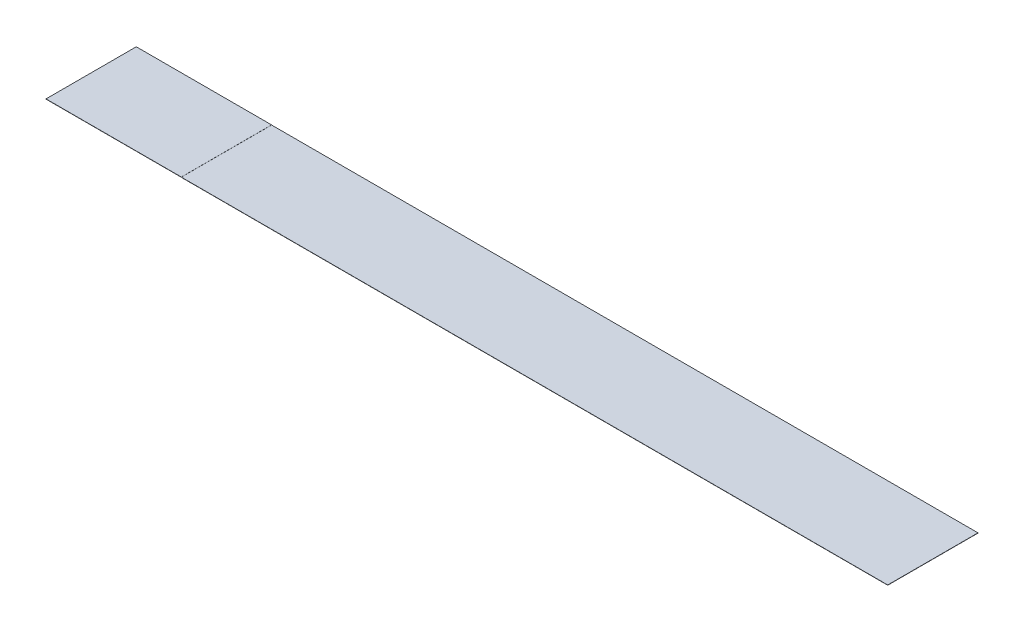
ISO-10303-21;
HEADER;
FILE_DESCRIPTION(('STEP AP214'),'2;1');
FILE_NAME('part.step','',(''),(''),'','','');
FILE_SCHEMA(('AUTOMOTIVE_DESIGN { 1 0 10303 214 1 1 1 1 }'));
ENDSEC;
DATA;
#1=APPLICATION_CONTEXT('core data for automotive mechanical design processes');
#2=APPLICATION_PROTOCOL_DEFINITION('international standard','automotive_design',2000,#1);
#3=PRODUCT_CONTEXT('',#1,'mechanical');
#4=PRODUCT('Part','Part','',(#3));
#5=PRODUCT_RELATED_PRODUCT_CATEGORY('part','',(#4));
#6=PRODUCT_DEFINITION_FORMATION('','',#4);
#7=PRODUCT_DEFINITION_CONTEXT('part definition',#1,'design');
#8=PRODUCT_DEFINITION('design','',#6,#7);
#9=PRODUCT_DEFINITION_SHAPE('','',#8);
#10=(LENGTH_UNIT() NAMED_UNIT(*) SI_UNIT(.MILLI.,.METRE.));
#11=(NAMED_UNIT(*) PLANE_ANGLE_UNIT() SI_UNIT($,.RADIAN.));
#12=(NAMED_UNIT(*) SI_UNIT($,.STERADIAN.) SOLID_ANGLE_UNIT());
#13=UNCERTAINTY_MEASURE_WITH_UNIT(LENGTH_MEASURE(1.E-05),#10,'distance_accuracy_value','');
#14=(GEOMETRIC_REPRESENTATION_CONTEXT(3) GLOBAL_UNCERTAINTY_ASSIGNED_CONTEXT((#13)) GLOBAL_UNIT_ASSIGNED_CONTEXT((#10,
#11,#12)) REPRESENTATION_CONTEXT('',''));
#15=CARTESIAN_POINT('',(0.,0.,0.));
#16=DIRECTION('',(0.,0.,1.));
#17=DIRECTION('',(1.,0.,0.));
#18=AXIS2_PLACEMENT_3D('',#15,#16,#17);
#19=CARTESIAN_POINT('',(264.4,0.15,30.5));
#20=DIRECTION('',(0.,1.,0.));
#21=DIRECTION('',(0.,0.,1.));
#22=AXIS2_PLACEMENT_3D('',#19,#20,#21);
#23=PLANE('',#22);
#24=DIRECTION('',(-1.,0.,0.));
#25=VECTOR('',#24,1.);
#26=CARTESIAN_POINT('',(-264.4,0.15,-30.5));
#27=LINE('',#26,#25);
#28=CARTESIAN_POINT('',(284.4,0.15,-30.5));
#29=VERTEX_POINT('',#28);
#30=CARTESIAN_POINT('',(-192.95,0.15,-30.5));
#31=VERTEX_POINT('',#30);
#32=EDGE_CURVE('E121',#29,#31,#27,.T.);
#33=ORIENTED_EDGE('',*,*,#32,.T.);
#34=DIRECTION('',(0.,0.,1.));
#35=VECTOR('',#34,1.);
#36=CARTESIAN_POINT('',(-192.95,0.15,-121.950025714684));
#37=LINE('',#36,#35);
#38=CARTESIAN_POINT('',(-192.95,0.15,30.5));
#39=VERTEX_POINT('',#38);
#40=EDGE_CURVE('E153',#31,#39,#37,.T.);
#41=ORIENTED_EDGE('',*,*,#40,.T.);
#42=DIRECTION('',(1.,0.,0.));
#43=VECTOR('',#42,1.);
#44=CARTESIAN_POINT('',(-264.4,0.15,30.5));
#45=LINE('',#44,#43);
#46=CARTESIAN_POINT('',(284.4,0.15,30.5));
#47=VERTEX_POINT('',#46);
#48=EDGE_CURVE('E41',#39,#47,#45,.T.);
#49=ORIENTED_EDGE('',*,*,#48,.T.);
#50=DIRECTION('',(0.,0.,-1.));
#51=VECTOR('',#50,1.);
#52=CARTESIAN_POINT('',(284.4,0.15,-30.5));
#53=LINE('',#52,#51);
#54=EDGE_CURVE('E141',#47,#29,#53,.T.);
#55=ORIENTED_EDGE('',*,*,#54,.T.);
#56=EDGE_LOOP('',(#33,#41,#49,#55));
#57=FACE_BOUND('',#56,.T.);
#58=ADVANCED_FACE('F33',(#57),#23,.T.);
#59=CARTESIAN_POINT('',(-264.4,0.15,-30.5));
#60=DIRECTION('',(0.,0.,1.));
#61=DIRECTION('',(1.,0.,0.));
#62=AXIS2_PLACEMENT_3D('',#59,#60,#61);
#63=PLANE('',#62);
#64=DIRECTION('',(0.,1.,0.));
#65=VECTOR('',#64,1.);
#66=CARTESIAN_POINT('',(-192.95,0.15,-30.5));
#67=LINE('',#66,#65);
#68=CARTESIAN_POINT('',(-192.95,0.,-30.5));
#69=VERTEX_POINT('',#68);
#70=CARTESIAN_POINT('',(-192.95,0.06858,-30.5));
#71=VERTEX_POINT('',#70);
#72=EDGE_CURVE('E104',#69,#71,#67,.T.);
#73=ORIENTED_EDGE('',*,*,#72,.T.);
#74=DIRECTION('',(-1.,0.,0.));
#75=VECTOR('',#74,1.);
#76=CARTESIAN_POINT('',(-264.4,0.06858,-30.5));
#77=LINE('',#76,#75);
#78=CARTESIAN_POINT('',(-284.4,0.06858,-30.5));
#79=VERTEX_POINT('',#78);
#80=EDGE_CURVE('E173',#71,#79,#77,.T.);
#81=ORIENTED_EDGE('',*,*,#80,.T.);
#82=DIRECTION('',(0.,1.,0.));
#83=VECTOR('',#82,1.);
#84=CARTESIAN_POINT('',(-284.4,-64.1950153828161,-30.5));
#85=LINE('',#84,#83);
#86=CARTESIAN_POINT('',(-284.4,0.21858,-30.5));
#87=VERTEX_POINT('',#86);
#88=EDGE_CURVE('E135',#79,#87,#85,.T.);
#89=ORIENTED_EDGE('',*,*,#88,.T.);
#90=DIRECTION('',(1.,0.,0.));
#91=VECTOR('',#90,1.);
#92=CARTESIAN_POINT('',(-284.4,0.21858,-30.5));
#93=LINE('',#92,#91);
#94=CARTESIAN_POINT('',(-192.95,0.21858,-30.5));
#95=VERTEX_POINT('',#94);
#96=EDGE_CURVE('E146',#87,#95,#93,.T.);
#97=ORIENTED_EDGE('',*,*,#96,.T.);
#98=DIRECTION('',(0.,-1.,0.));
#99=VECTOR('',#98,1.);
#100=CARTESIAN_POINT('',(-192.95,0.15,-30.5));
#101=LINE('',#100,#99);
#102=EDGE_CURVE('E158',#95,#31,#101,.T.);
#103=ORIENTED_EDGE('',*,*,#102,.T.);
#104=ORIENTED_EDGE('',*,*,#32,.F.);
#105=DIRECTION('',(0.,1.,0.));
#106=VECTOR('',#105,1.);
#107=CARTESIAN_POINT('',(284.4,-64.1950153828161,-30.5));
#108=LINE('',#107,#106);
#109=CARTESIAN_POINT('',(284.4,0.,-30.5));
#110=VERTEX_POINT('',#109);
#111=EDGE_CURVE('E140',#110,#29,#108,.T.);
#112=ORIENTED_EDGE('',*,*,#111,.F.);
#113=DIRECTION('',(-1.,0.,0.));
#114=VECTOR('',#113,1.);
#115=CARTESIAN_POINT('',(-264.4,0.,-30.5));
#116=LINE('',#115,#114);
#117=EDGE_CURVE('E122',#110,#69,#116,.T.);
#118=ORIENTED_EDGE('',*,*,#117,.T.);
#119=EDGE_LOOP('',(#73,#81,#89,#97,#103,#104,#112,#118));
#120=FACE_BOUND('',#119,.T.);
#121=ADVANCED_FACE('F35',(#120),#63,.F.);
#122=CARTESIAN_POINT('',(-264.4,0.15,30.5));
#123=DIRECTION('',(0.,0.,-1.));
#124=DIRECTION('',(-1.,0.,0.));
#125=AXIS2_PLACEMENT_3D('',#122,#123,#124);
#126=PLANE('',#125);
#127=DIRECTION('',(0.,1.,0.));
#128=VECTOR('',#127,1.);
#129=CARTESIAN_POINT('',(-284.4,-64.1950153828161,30.5));
#130=LINE('',#129,#128);
#131=CARTESIAN_POINT('',(-284.4,0.0685799999999986,30.5));
#132=VERTEX_POINT('',#131);
#133=CARTESIAN_POINT('',(-284.4,0.21858,30.5));
#134=VERTEX_POINT('',#133);
#135=EDGE_CURVE('E126',#132,#134,#130,.T.);
#136=ORIENTED_EDGE('',*,*,#135,.F.);
#137=DIRECTION('',(-1.,0.,0.));
#138=VECTOR('',#137,1.);
#139=CARTESIAN_POINT('',(-284.4,0.06858,30.5));
#140=LINE('',#139,#138);
#141=CARTESIAN_POINT('',(-192.95,0.06858,30.5));
#142=VERTEX_POINT('',#141);
#143=EDGE_CURVE('E47',#142,#132,#140,.T.);
#144=ORIENTED_EDGE('',*,*,#143,.F.);
#145=DIRECTION('',(0.,1.,0.));
#146=VECTOR('',#145,1.);
#147=CARTESIAN_POINT('',(-192.95,0.,30.5));
#148=LINE('',#147,#146);
#149=CARTESIAN_POINT('',(-192.95,0.,30.5));
#150=VERTEX_POINT('',#149);
#151=EDGE_CURVE('E102',#150,#142,#148,.T.);
#152=ORIENTED_EDGE('',*,*,#151,.F.);
#153=DIRECTION('',(1.,0.,0.));
#154=VECTOR('',#153,1.);
#155=CARTESIAN_POINT('',(-264.4,0.,30.5));
#156=LINE('',#155,#154);
#157=CARTESIAN_POINT('',(284.4,0.,30.5));
#158=VERTEX_POINT('',#157);
#159=EDGE_CURVE('E114',#150,#158,#156,.T.);
#160=ORIENTED_EDGE('',*,*,#159,.T.);
#161=DIRECTION('',(0.,1.,0.));
#162=VECTOR('',#161,1.);
#163=CARTESIAN_POINT('',(284.4,-64.1950153828161,30.5));
#164=LINE('',#163,#162);
#165=EDGE_CURVE('E138',#158,#47,#164,.T.);
#166=ORIENTED_EDGE('',*,*,#165,.T.);
#167=ORIENTED_EDGE('',*,*,#48,.F.);
#168=DIRECTION('',(0.,1.,0.));
#169=VECTOR('',#168,1.);
#170=CARTESIAN_POINT('',(-192.95,0.15,30.5));
#171=LINE('',#170,#169);
#172=CARTESIAN_POINT('',(-192.95,0.21858,30.5));
#173=VERTEX_POINT('',#172);
#174=EDGE_CURVE('E55',#39,#173,#171,.T.);
#175=ORIENTED_EDGE('',*,*,#174,.T.);
#176=DIRECTION('',(-1.,0.,0.));
#177=VECTOR('',#176,1.);
#178=CARTESIAN_POINT('',(-284.4,0.21858,30.5));
#179=LINE('',#178,#177);
#180=EDGE_CURVE('E156',#173,#134,#179,.T.);
#181=ORIENTED_EDGE('',*,*,#180,.T.);
#182=EDGE_LOOP('',(#136,#144,#152,#160,#166,#167,#175,#181));
#183=FACE_BOUND('',#182,.T.);
#184=ADVANCED_FACE('F112',(#183),#126,.F.);
#185=CARTESIAN_POINT('',(264.4,0.,30.5));
#186=DIRECTION('',(0.,1.,0.));
#187=DIRECTION('',(0.,0.,1.));
#188=AXIS2_PLACEMENT_3D('',#185,#186,#187);
#189=PLANE('',#188);
#190=ORIENTED_EDGE('',*,*,#159,.F.);
#191=DIRECTION('',(0.,0.,1.));
#192=VECTOR('',#191,1.);
#193=CARTESIAN_POINT('',(-192.95,0.,-30.50005));
#194=LINE('',#193,#192);
#195=EDGE_CURVE('E98',#69,#150,#194,.T.);
#196=ORIENTED_EDGE('',*,*,#195,.F.);
#197=ORIENTED_EDGE('',*,*,#117,.F.);
#198=DIRECTION('',(0.,0.,1.));
#199=VECTOR('',#198,1.);
#200=CARTESIAN_POINT('',(284.4,0.,-30.5));
#201=LINE('',#200,#199);
#202=EDGE_CURVE('E119',#110,#158,#201,.T.);
#203=ORIENTED_EDGE('',*,*,#202,.T.);
#204=EDGE_LOOP('',(#190,#196,#197,#203));
#205=FACE_BOUND('',#204,.T.);
#206=ADVANCED_FACE('F117',(#205),#189,.F.);
#207=CARTESIAN_POINT('',(-284.4,-64.1950153828161,-30.5));
#208=DIRECTION('',(-1.,0.,0.));
#209=DIRECTION('',(0.,0.,1.));
#210=AXIS2_PLACEMENT_3D('',#207,#208,#209);
#211=PLANE('',#210);
#212=DIRECTION('',(0.,0.,-1.));
#213=VECTOR('',#212,1.);
#214=CARTESIAN_POINT('',(-284.4,0.0685799999999986,-30.5));
#215=LINE('',#214,#213);
#216=EDGE_CURVE('E11',#132,#79,#215,.T.);
#217=ORIENTED_EDGE('',*,*,#216,.F.);
#218=ORIENTED_EDGE('',*,*,#135,.T.);
#219=DIRECTION('',(0.,0.,1.));
#220=VECTOR('',#219,1.);
#221=CARTESIAN_POINT('',(-284.4,0.21858,-121.950025714684));
#222=LINE('',#221,#220);
#223=EDGE_CURVE('E159',#87,#134,#222,.T.);
#224=ORIENTED_EDGE('',*,*,#223,.F.);
#225=ORIENTED_EDGE('',*,*,#88,.F.);
#226=EDGE_LOOP('',(#217,#218,#224,#225));
#227=FACE_BOUND('',#226,.T.);
#228=ADVANCED_FACE('F189',(#227),#211,.T.);
#229=CARTESIAN_POINT('',(284.4,-64.1950153828161,-30.5));
#230=DIRECTION('',(1.,0.,0.));
#231=DIRECTION('',(0.,0.,-1.));
#232=AXIS2_PLACEMENT_3D('',#229,#230,#231);
#233=PLANE('',#232);
#234=ORIENTED_EDGE('',*,*,#202,.F.);
#235=ORIENTED_EDGE('',*,*,#111,.T.);
#236=ORIENTED_EDGE('',*,*,#54,.F.);
#237=ORIENTED_EDGE('',*,*,#165,.F.);
#238=EDGE_LOOP('',(#234,#235,#236,#237));
#239=FACE_BOUND('',#238,.T.);
#240=ADVANCED_FACE('F181',(#239),#233,.T.);
#241=CARTESIAN_POINT('',(-284.4,0.21858,-121.950025714684));
#242=DIRECTION('',(0.,1.,0.));
#243=DIRECTION('',(0.,0.,1.));
#244=AXIS2_PLACEMENT_3D('',#241,#242,#243);
#245=PLANE('',#244);
#246=ORIENTED_EDGE('',*,*,#96,.F.);
#247=ORIENTED_EDGE('',*,*,#223,.T.);
#248=ORIENTED_EDGE('',*,*,#180,.F.);
#249=DIRECTION('',(0.,0.,1.));
#250=VECTOR('',#249,1.);
#251=CARTESIAN_POINT('',(-192.95,0.21858,-121.950025714684));
#252=LINE('',#251,#250);
#253=EDGE_CURVE('E150',#95,#173,#252,.T.);
#254=ORIENTED_EDGE('',*,*,#253,.F.);
#255=EDGE_LOOP('',(#246,#247,#248,#254));
#256=FACE_BOUND('',#255,.T.);
#257=ADVANCED_FACE('F187',(#256),#245,.T.);
#258=CARTESIAN_POINT('',(-192.95,0.15,-121.950025714684));
#259=DIRECTION('',(1.,0.,0.));
#260=DIRECTION('',(0.,0.,-1.));
#261=AXIS2_PLACEMENT_3D('',#258,#259,#260);
#262=PLANE('',#261);
#263=ORIENTED_EDGE('',*,*,#102,.F.);
#264=ORIENTED_EDGE('',*,*,#253,.T.);
#265=ORIENTED_EDGE('',*,*,#174,.F.);
#266=ORIENTED_EDGE('',*,*,#40,.F.);
#267=EDGE_LOOP('',(#263,#264,#265,#266));
#268=FACE_BOUND('',#267,.T.);
#269=ADVANCED_FACE('F185',(#268),#262,.T.);
#270=CARTESIAN_POINT('',(-192.95,0.,-30.50005));
#271=DIRECTION('',(1.,0.,0.));
#272=DIRECTION('',(0.,0.,-1.));
#273=AXIS2_PLACEMENT_3D('',#270,#271,#272);
#274=PLANE('',#273);
#275=ORIENTED_EDGE('',*,*,#195,.T.);
#276=ORIENTED_EDGE('',*,*,#151,.T.);
#277=DIRECTION('',(0.,0.,1.));
#278=VECTOR('',#277,1.);
#279=CARTESIAN_POINT('',(-192.95,0.06858,-30.50005));
#280=LINE('',#279,#278);
#281=EDGE_CURVE('E108',#71,#142,#280,.T.);
#282=ORIENTED_EDGE('',*,*,#281,.F.);
#283=ORIENTED_EDGE('',*,*,#72,.F.);
#284=EDGE_LOOP('',(#275,#276,#282,#283));
#285=FACE_BOUND('',#284,.T.);
#286=ADVANCED_FACE('F100',(#285),#274,.F.);
#287=CARTESIAN_POINT('',(-284.4,0.06858,-30.50005));
#288=DIRECTION('',(0.,1.,0.));
#289=DIRECTION('',(0.,0.,1.));
#290=AXIS2_PLACEMENT_3D('',#287,#288,#289);
#291=PLANE('',#290);
#292=ORIENTED_EDGE('',*,*,#281,.T.);
#293=ORIENTED_EDGE('',*,*,#143,.T.);
#294=ORIENTED_EDGE('',*,*,#216,.T.);
#295=ORIENTED_EDGE('',*,*,#80,.F.);
#296=EDGE_LOOP('',(#292,#293,#294,#295));
#297=FACE_BOUND('',#296,.T.);
#298=ADVANCED_FACE('F177',(#297),#291,.F.);
#299=CLOSED_SHELL('',(#58,#121,#184,#206,#228,#240,#257,#269,#286,#298));
#300=MANIFOLD_SOLID_BREP('B2',#299);
#301=ADVANCED_BREP_SHAPE_REPRESENTATION('',(#18,#300),#14);
#302=SHAPE_DEFINITION_REPRESENTATION(#9,#301);
ENDSEC;
END-ISO-10303-21;
